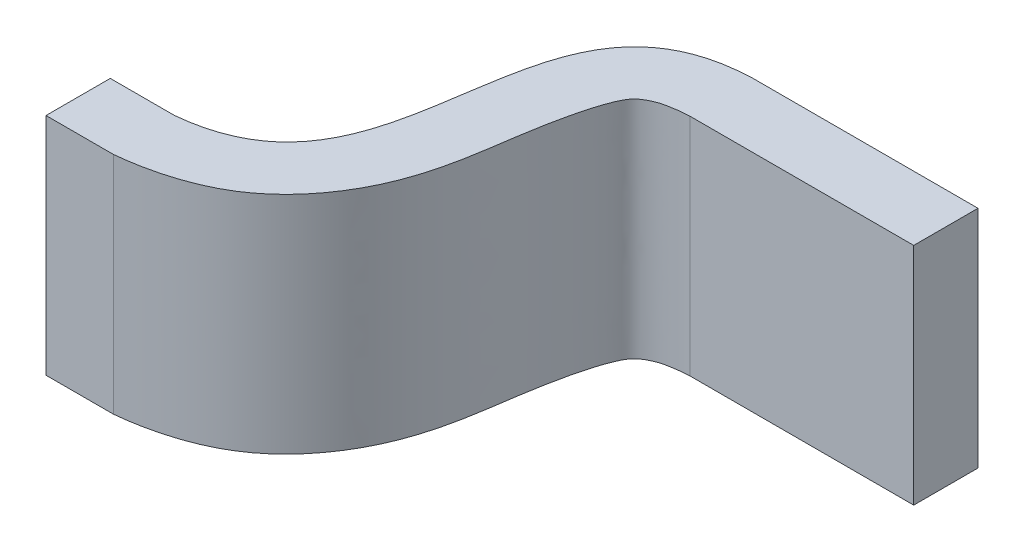
ISO-10303-21;
HEADER;
FILE_DESCRIPTION(('STEP AP214'),'2;1');
FILE_NAME('part.step','',(''),(''),'','','');
FILE_SCHEMA(('AUTOMOTIVE_DESIGN { 1 0 10303 214 1 1 1 1 }'));
ENDSEC;
DATA;
#1=APPLICATION_CONTEXT('core data for automotive mechanical design processes');
#2=APPLICATION_PROTOCOL_DEFINITION('international standard','automotive_design',2000,#1);
#3=PRODUCT_CONTEXT('',#1,'mechanical');
#4=PRODUCT('Part','Part','',(#3));
#5=PRODUCT_RELATED_PRODUCT_CATEGORY('part','',(#4));
#6=PRODUCT_DEFINITION_FORMATION('','',#4);
#7=PRODUCT_DEFINITION_CONTEXT('part definition',#1,'design');
#8=PRODUCT_DEFINITION('design','',#6,#7);
#9=PRODUCT_DEFINITION_SHAPE('','',#8);
#10=(LENGTH_UNIT() NAMED_UNIT(*) SI_UNIT(.MILLI.,.METRE.));
#11=(NAMED_UNIT(*) PLANE_ANGLE_UNIT() SI_UNIT($,.RADIAN.));
#12=(NAMED_UNIT(*) SI_UNIT($,.STERADIAN.) SOLID_ANGLE_UNIT());
#13=UNCERTAINTY_MEASURE_WITH_UNIT(LENGTH_MEASURE(1.E-05),#10,'distance_accuracy_value','');
#14=(GEOMETRIC_REPRESENTATION_CONTEXT(3) GLOBAL_UNCERTAINTY_ASSIGNED_CONTEXT((#13)) GLOBAL_UNIT_ASSIGNED_CONTEXT((#10,
#11,#12)) REPRESENTATION_CONTEXT('',''));
#15=CARTESIAN_POINT('',(0.,0.,0.));
#16=DIRECTION('',(0.,0.,1.));
#17=DIRECTION('',(1.,0.,0.));
#18=AXIS2_PLACEMENT_3D('',#15,#16,#17);
#19=CARTESIAN_POINT('',(0.381062000989914,0.523123965857835,1.2000000284124));
#20=DIRECTION('',(0.,1.,4.37113882867379E-08));
#21=DIRECTION('',(-1.,0.,0.));
#22=AXIS2_PLACEMENT_3D('',#19,#20,#21);
#23=PLANE('',#22);
#24=DIRECTION('',(1.,0.,0.));
#25=VECTOR('',#24,1.);
#26=CARTESIAN_POINT('',(8.21956578272591,0.523124009569223,0.200000028412402));
#27=LINE('',#26,#25);
#28=CARTESIAN_POINT('',(8.21956578272591,0.523124009569223,0.200000028412402));
#29=VERTEX_POINT('',#28);
#30=CARTESIAN_POINT('',(8.91606200098991,0.523124009569223,0.200000028412402));
#31=VERTEX_POINT('',#30);
#32=EDGE_CURVE('E11',#29,#31,#27,.T.);
#33=ORIENTED_EDGE('',*,*,#32,.F.);
#34=CARTESIAN_POINT('',(8.21956578272591,0.523124009569223,0.200000028412402));
#35=CARTESIAN_POINT('',(8.21399807265752,0.52312400955949,0.200222689522129));
#36=CARTESIAN_POINT('',(8.20843683975348,0.523124009544197,0.200572554479812));
#37=CARTESIAN_POINT('',(8.19732835868844,0.523124009503627,0.201500686980735));
#38=CARTESIAN_POINT('',(8.19178112714533,0.523124009478342,0.202079155292227));
#39=CARTESIAN_POINT('',(8.18066889231238,0.523124009418716,0.203443235011885));
#40=CARTESIAN_POINT('',(8.17510408096633,0.523124009384307,0.204230406804731));
#41=CARTESIAN_POINT('',(8.16401243640824,0.52312400930556,0.206031938032742));
#42=CARTESIAN_POINT('',(8.15848559635561,0.523124009261223,0.207046255379066));
#43=CARTESIAN_POINT('',(8.1465743503038,0.523124009148399,0.209627352515907));
#44=CARTESIAN_POINT('',(8.14020246940725,0.5231240090771,0.21125844557323));
#45=CARTESIAN_POINT('',(8.12921644404484,0.523124008918531,0.214886194813635));
#46=CARTESIAN_POINT('',(8.12454576276441,0.523124008839135,0.216702673148474));
#47=CARTESIAN_POINT('',(8.11575076349414,0.523124008662512,0.220743053151341));
#48=CARTESIAN_POINT('',(8.11161057174428,0.523124008566729,0.222933941860099));
#49=CARTESIAN_POINT('',(8.10253183379761,0.523124008340737,0.228105201448088));
#50=CARTESIAN_POINT('',(8.09762635625911,0.523124008207656,0.231151708136343));
#51=CARTESIAN_POINT('',(8.09022405842898,0.523124007950491,0.23703140699628));
#52=CARTESIAN_POINT('',(8.08749164440591,0.523124007840085,0.239554098690417));
#53=CARTESIAN_POINT('',(8.08246087272024,0.523124007602267,0.245002743933271));
#54=CARTESIAN_POINT('',(8.08016330387861,0.523124007474825,0.247929413995591));
#55=CARTESIAN_POINT('',(8.0759951087917,0.523124007211017,0.253960548834216));
#56=CARTESIAN_POINT('',(8.07411551519148,0.523124007074941,0.257059016316074));
#57=CARTESIAN_POINT('',(8.0706064493533,0.523124006798388,0.263392895839739));
#58=CARTESIAN_POINT('',(8.06897710136162,0.523124006657908,0.266628374896965));
#59=CARTESIAN_POINT('',(8.06367328775614,0.523124006170111,0.277849874002466));
#60=CARTESIAN_POINT('',(8.06040085858409,0.523124005813888,0.286022060199968));
#61=CARTESIAN_POINT('',(8.05218527798451,0.523124004834806,0.30842217161417));
#62=CARTESIAN_POINT('',(8.04771455008864,0.523124004202933,0.322813264888977));
#63=CARTESIAN_POINT('',(8.03961753260656,0.523124002947858,0.351469930130036));
#64=CARTESIAN_POINT('',(8.03597437543715,0.523124002324784,0.365730933740904));
#65=CARTESIAN_POINT('',(8.02919339350917,0.523124001073496,0.394362148604283));
#66=CARTESIAN_POINT('',(8.02605527280588,0.523124000445286,0.408732290694726));
#67=CARTESIAN_POINT('',(8.01736410075411,0.523123998591494,0.451139552140372));
#68=CARTESIAN_POINT('',(8.01232518312451,0.523123997361367,0.479282765244954));
#69=CARTESIAN_POINT('',(8.00335647907098,0.52312399489047,0.535811203708824));
#70=CARTESIAN_POINT('',(7.99942969347175,0.52312399364968,0.564196874894819));
#71=CARTESIAN_POINT('',(7.99170167000416,0.523123991397096,0.61572979603454));
#72=CARTESIAN_POINT('',(7.98800715437185,0.523123990384639,0.63889213906133));
#73=CARTESIAN_POINT('',(7.9794355355205,0.523123988368946,0.685005838505776));
#74=CARTESIAN_POINT('',(7.97455858675596,0.523123987365709,0.70795722207379));
#75=CARTESIAN_POINT('',(7.96311271686074,0.523123985382331,0.753331627106404));
#76=CARTESIAN_POINT('',(7.95655194608926,0.523123984402102,0.775756641066975));
#77=CARTESIAN_POINT('',(7.94136784202336,0.523123982472811,0.819893680216221));
#78=CARTESIAN_POINT('',(7.93274558328641,0.523123981523734,0.841606070178963));
#79=CARTESIAN_POINT('',(7.91043792110495,0.523123979401444,0.890158404680554));
#80=CARTESIAN_POINT('',(7.89600936729223,0.523123978242904,0.916662671017735));
#81=CARTESIAN_POINT('',(7.86347434987592,0.523123976024518,0.967413431258293));
#82=CARTESIAN_POINT('',(7.8453597746674,0.523123974964896,0.991654770611745));
#83=CARTESIAN_POINT('',(7.80790002602411,0.523123973106425,1.03417163444858));
#84=CARTESIAN_POINT('',(7.78897432705133,0.523123972291533,1.0528141777067));
#85=CARTESIAN_POINT('',(7.74844565833539,0.523123970804785,1.08682698482442));
#86=CARTESIAN_POINT('',(7.72685155874366,0.523123970132475,1.10220765192534));
#87=CARTESIAN_POINT('',(7.68359472899702,0.52312396901348,1.12780728885139));
#88=CARTESIAN_POINT('',(7.66213857495581,0.523123968551308,1.13838054359417));
#89=CARTESIAN_POINT('',(7.61806563506122,0.523123967740708,1.15692492218508));
#90=CARTESIAN_POINT('',(7.59544469766516,0.523123967392724,1.16488586802287));
#91=CARTESIAN_POINT('',(7.54848495398505,0.523123966783858,1.17881510607821));
#92=CARTESIAN_POINT('',(7.52411482818412,0.523123966527663,1.18467615175865));
#93=CARTESIAN_POINT('',(7.47514110847119,0.52312396611885,1.19402868396042));
#94=CARTESIAN_POINT('',(7.4505414125435,0.523123965965347,1.19754041861071));
#95=CARTESIAN_POINT('',(7.42586117783791,0.523123965857835,1.2000000284124));
#96=B_SPLINE_CURVE_WITH_KNOTS('',3,(#34,#35,#36,#37,#38,#39,#40,#41,#42,#43,#44,#45,#46,#47,#48,
#49,#50,#51,#52,#53,#54,#55,#56,#57,#58,#59,#60,#61,#62,#63,#64,#65,#66,#67,#68,#69,#70,#71,#72,
#73,#74,#75,#76,#77,#78,#79,#80,#81,#82,#83,#84,#85,#86,#87,#88,#89,#90,#91,#92,#93,#94,#95),
.UNSPECIFIED.,.F.,.F.,(4,2,2,2,2,2,2,2,2,2,2,2,2,2,2,2,2,2,2,2,2,2,2,2,2,2,2,2,2,2,4),(0.,
0.0167129049826592,0.0334405206169283,0.0502969119078463,0.0671501823813333,0.086844997792569,
0.101838970321101,0.115885127156847,0.133132127804882,0.144236213112224,0.155360252414285,
0.166215762863006,0.177076645740437,0.203446553112075,0.248618617741088,0.29276509657911,
0.336885611219411,0.422622380023037,0.508588331833531,0.578941414817067,0.649285312924714,
0.719294937731861,0.789268149044622,0.879502218060836,0.969937050040234,1.04934324822107,
1.12849225200605,1.200024637838,1.27183250557101,1.34691026454657,1.42133231106535),.UNSPECIFIED.);
#97=CARTESIAN_POINT('',(7.42586117783791,0.523123965857835,1.2000000284124));
#98=VERTEX_POINT('',#97);
#99=EDGE_CURVE('E186',#29,#98,#96,.T.);
#100=ORIENTED_EDGE('',*,*,#99,.T.);
#101=DIRECTION('',(1.,0.,0.));
#102=VECTOR('',#101,1.);
#103=CARTESIAN_POINT('',(7.21606200098991,0.523123965857834,1.2000000284124));
#104=LINE('',#103,#102);
#105=CARTESIAN_POINT('',(7.21606200098991,0.523123965857835,1.2000000284124));
#106=VERTEX_POINT('',#105);
#107=EDGE_CURVE('E163',#106,#98,#104,.T.);
#108=ORIENTED_EDGE('',*,*,#107,.F.);
#109=DIRECTION('',(0.,4.37113883977602E-08,-0.999999999999999));
#110=VECTOR('',#109,1.);
#111=CARTESIAN_POINT('',(7.21606200098991,0.523123965857835,1.2000000284124));
#112=LINE('',#111,#110);
#113=CARTESIAN_POINT('',(7.21606200098991,0.523123974600112,1.0000000284124));
#114=VERTEX_POINT('',#113);
#115=EDGE_CURVE('E155',#106,#114,#112,.T.);
#116=ORIENTED_EDGE('',*,*,#115,.T.);
#117=DIRECTION('',(-1.,0.,0.));
#118=VECTOR('',#117,1.);
#119=CARTESIAN_POINT('',(7.41606200098991,0.523123974600113,1.0000000284124));
#120=LINE('',#119,#118);
#121=CARTESIAN_POINT('',(7.41606200098991,0.523123974600112,1.0000000284124));
#122=VERTEX_POINT('',#121);
#123=EDGE_CURVE('E148',#122,#114,#120,.T.);
#124=ORIENTED_EDGE('',*,*,#123,.F.);
#125=CARTESIAN_POINT('',(8.21606200098991,0.523124018311501,2.84124024121632E-08));
#126=CARTESIAN_POINT('',(8.19358510313693,0.523124018278632,0.000751973045804594));
#127=CARTESIAN_POINT('',(8.17100793476501,0.523124018200959,0.00252892635576407));
#128=CARTESIAN_POINT('',(8.12597309478915,0.523124017918698,0.00898631281109999));
#129=CARTESIAN_POINT('',(8.10352138339691,0.523124017712372,0.0137065199884059));
#130=CARTESIAN_POINT('',(8.06515365819845,0.523124017206176,0.0252869208885321));
#131=CARTESIAN_POINT('',(8.04899929251523,0.523124016942265,0.0313244996495291));
#132=CARTESIAN_POINT('',(8.01789140683102,0.523124016308798,0.0458165330653677));
#133=CARTESIAN_POINT('',(8.00293202850773,0.523124015939804,0.0542581347862222));
#134=CARTESIAN_POINT('',(7.97580927414815,0.523124015127175,0.0728489137987579));
#135=CARTESIAN_POINT('',(7.96351851659414,0.523124014691697,0.0828114897177421));
#136=CARTESIAN_POINT('',(7.94069381725784,0.523124013739438,0.104596633966451));
#137=CARTESIAN_POINT('',(7.93016206041085,0.523124013222557,0.116421480619356));
#138=CARTESIAN_POINT('',(7.90934268339576,0.523124012034324,0.143605077884774));
#139=CARTESIAN_POINT('',(7.89939730340265,0.52312401135163,0.159223306458098));
#140=CARTESIAN_POINT('',(7.8817786902267,0.523124009931813,0.191704937205947));
#141=CARTESIAN_POINT('',(7.87411125124448,0.523124009194558,0.208571380664586));
#142=CARTESIAN_POINT('',(7.85831224281672,0.523124007435963,0.248803345104274));
#143=CARTESIAN_POINT('',(7.85089650929936,0.523124006402683,0.272442033282066));
#144=CARTESIAN_POINT('',(7.83819654268846,0.523124004313759,0.320231039974889));
#145=CARTESIAN_POINT('',(7.83291120075709,0.523124003258126,0.344381085428394));
#146=CARTESIAN_POINT('',(7.82019523572656,0.523124000384108,0.41013095442911));
#147=CARTESIAN_POINT('',(7.81390954748545,0.523123998556826,0.451934314660284));
#148=CARTESIAN_POINT('',(7.80123041061268,0.523123994892434,0.535765841283035));
#149=CARTESIAN_POINT('',(7.79483655698354,0.523123993055326,0.577793964269863));
#150=CARTESIAN_POINT('',(7.78272745030488,0.523123990363762,0.6393697611756));
#151=CARTESIAN_POINT('',(7.77840818033406,0.523123989498192,0.659171695464002));
#152=CARTESIAN_POINT('',(7.76846333575577,0.523123987780332,0.698471750789634));
#153=CARTESIAN_POINT('',(7.76283677771603,0.523123986928053,0.717969631254131));
#154=CARTESIAN_POINT('',(7.74980357127117,0.523123985258905,0.756155277243095));
#155=CARTESIAN_POINT('',(7.7424162483515,0.523123984441759,0.774849402330931));
#156=CARTESIAN_POINT('',(7.72528765923403,0.523123982856935,0.811105960776874));
#157=CARTESIAN_POINT('',(7.71555219177743,0.523123982089141,0.828671049014009));
#158=CARTESIAN_POINT('',(7.69291712212291,0.523123980608703,0.862539528703548));
#159=CARTESIAN_POINT('',(7.67992280719315,0.523123979898752,0.878781289982292));
#160=CARTESIAN_POINT('',(7.6509915949129,0.523123978604453,0.908391388716107));
#161=CARTESIAN_POINT('',(7.63505740825526,0.523123978019989,0.921762348802611));
#162=CARTESIAN_POINT('',(7.60251216289671,0.523123977046078,0.944042841853135));
#163=CARTESIAN_POINT('',(7.58610329850445,0.523123976643516,0.953252414485398));
#164=CARTESIAN_POINT('',(7.55200247896581,0.523123975953836,0.969030441043196));
#165=CARTESIAN_POINT('',(7.53430550805647,0.523123975667202,0.975587838389974));
#166=CARTESIAN_POINT('',(7.49987529020758,0.523123975217356,0.985879127327204));
#167=CARTESIAN_POINT('',(7.48319962545166,0.523123975045326,0.989814734575921));
#168=CARTESIAN_POINT('',(7.44971156339336,0.523123974773376,0.996036229262667));
#169=CARTESIAN_POINT('',(7.43290223265527,0.523123974672748,0.998338325880506));
#170=CARTESIAN_POINT('',(7.41606200098991,0.523123974600112,1.0000000284124));
#171=B_SPLINE_CURVE_WITH_KNOTS('',3,(#125,#126,#127,#128,#129,#130,#131,#132,#133,#134,#135,
#136,#137,#138,#139,#140,#141,#142,#143,#144,#145,#146,#147,#148,#149,#150,#151,#152,#153,#154,
#155,#156,#157,#158,#159,#160,#161,#162,#163,#164,#165,#166,#167,#168,#169,#170),.UNSPECIFIED.,
.F.,.F.,(4,2,2,2,2,2,2,2,2,2,2,2,2,2,2,2,2,2,2,2,2,2,4),(0.,0.0676605368254322,
0.136255841823736,0.187815232472042,0.239103979458815,0.28635747593516,0.333669238509404,
0.38897897184657,0.444428210357159,0.518581097757562,0.592695339665635,0.719482422739692,
0.846974988060578,0.907746805484854,0.968564488536604,1.02874313069962,1.08877465652057,
1.15080863583323,1.21278570033354,1.2689745883637,1.32539536427915,1.3767136749948,
1.42751535438906),.UNSPECIFIED.);
#172=CARTESIAN_POINT('',(8.21606200098991,0.523124018311501,2.84124023863797E-08));
#173=VERTEX_POINT('',#172);
#174=EDGE_CURVE('E99',#173,#122,#171,.T.);
#175=ORIENTED_EDGE('',*,*,#174,.F.);
#176=DIRECTION('',(1.,0.,0.));
#177=VECTOR('',#176,1.);
#178=CARTESIAN_POINT('',(8.21606200098991,0.523124018311501,2.84124023863797E-08));
#179=LINE('',#178,#177);
#180=CARTESIAN_POINT('',(8.91606200098991,0.523124018311501,2.84124023863797E-08));
#181=VERTEX_POINT('',#180);
#182=EDGE_CURVE('E93',#173,#181,#179,.T.);
#183=ORIENTED_EDGE('',*,*,#182,.T.);
#184=DIRECTION('',(0.,4.37113883977602E-08,-0.999999999999999));
#185=VECTOR('',#184,1.);
#186=CARTESIAN_POINT('',(8.91606200098991,0.523124009569223,0.200000028412402));
#187=LINE('',#186,#185);
#188=EDGE_CURVE('E194',#31,#181,#187,.T.);
#189=ORIENTED_EDGE('',*,*,#188,.F.);
#190=EDGE_LOOP('',(#33,#100,#108,#116,#124,#175,#183,#189));
#191=FACE_BOUND('',#190,.T.);
#192=ADVANCED_FACE('F17',(#191),#23,.F.);
#193=CARTESIAN_POINT('',(8.91606200098991,-0.126876034142165,1.2));
#194=DIRECTION('',(-1.,0.,0.));
#195=DIRECTION('',(0.,-1.,-4.37113882867379E-08));
#196=AXIS2_PLACEMENT_3D('',#193,#194,#195);
#197=PLANE('',#196);
#198=DIRECTION('',(0.,-0.999999999999999,-4.37113881598552E-08));
#199=VECTOR('',#198,1.);
#200=CARTESIAN_POINT('',(8.91606200098991,1.22312400956922,0.200000059010374));
#201=LINE('',#200,#199);
#202=CARTESIAN_POINT('',(8.91606200098991,1.22312400956922,0.200000059010374));
#203=VERTEX_POINT('',#202);
#204=EDGE_CURVE('E25',#203,#31,#201,.T.);
#205=ORIENTED_EDGE('',*,*,#204,.T.);
#206=ORIENTED_EDGE('',*,*,#188,.T.);
#207=DIRECTION('',(0.,0.999999999999999,4.37113882867379E-08));
#208=VECTOR('',#207,1.);
#209=CARTESIAN_POINT('',(8.91606200098991,0.523124018311501,2.84124023863797E-08));
#210=LINE('',#209,#208);
#211=CARTESIAN_POINT('',(8.91606200098991,1.2231240183115,5.90103741870962E-08));
#212=VERTEX_POINT('',#211);
#213=EDGE_CURVE('E157',#181,#212,#210,.T.);
#214=ORIENTED_EDGE('',*,*,#213,.T.);
#215=DIRECTION('',(0.,4.37113878426487E-08,-0.999999999999999));
#216=VECTOR('',#215,1.);
#217=CARTESIAN_POINT('',(8.91606200098991,1.22312400956922,0.200000059010374));
#218=LINE('',#217,#216);
#219=EDGE_CURVE('E150',#203,#212,#218,.T.);
#220=ORIENTED_EDGE('',*,*,#219,.F.);
#221=EDGE_LOOP('',(#205,#206,#214,#220));
#222=FACE_BOUND('',#221,.T.);
#223=ADVANCED_FACE('F205',(#222),#197,.F.);
#224=CARTESIAN_POINT('',(0.381062000989914,1.22312396585783,1.20000005901037));
#225=DIRECTION('',(0.,1.,4.37113882867379E-08));
#226=DIRECTION('',(-1.,0.,0.));
#227=AXIS2_PLACEMENT_3D('',#224,#225,#226);
#228=PLANE('',#227);
#229=CARTESIAN_POINT('',(8.21956578272591,1.22312400956922,0.200000059010374));
#230=CARTESIAN_POINT('',(8.21399807265752,1.22312400955948,0.200222720120101));
#231=CARTESIAN_POINT('',(8.20843683975348,1.22312400954419,0.200572585077784));
#232=CARTESIAN_POINT('',(8.19732835868844,1.22312400950362,0.201500717578707));
#233=CARTESIAN_POINT('',(8.19178112714533,1.22312400947834,0.202079185890199));
#234=CARTESIAN_POINT('',(8.18066889231238,1.22312400941871,0.203443265609857));
#235=CARTESIAN_POINT('',(8.17510408096633,1.2231240093843,0.204230437402703));
#236=CARTESIAN_POINT('',(8.16401243640824,1.22312400930556,0.206031968630714));
#237=CARTESIAN_POINT('',(8.15848559635561,1.22312400926122,0.207046285977038));
#238=CARTESIAN_POINT('',(8.1465743503038,1.22312400914841,0.209627383113879));
#239=CARTESIAN_POINT('',(8.14020246940725,1.22312400907711,0.211258476171202));
#240=CARTESIAN_POINT('',(8.12921644404484,1.22312400891852,0.214886225411607));
#241=CARTESIAN_POINT('',(8.12454576276441,1.22312400883912,0.216702703746445));
#242=CARTESIAN_POINT('',(8.11575076349414,1.22312400866253,0.220743083749313));
#243=CARTESIAN_POINT('',(8.11161057174428,1.22312400856678,0.222933972458071));
#244=CARTESIAN_POINT('',(8.10253183379761,1.22312400834067,0.22810523204606));
#245=CARTESIAN_POINT('',(8.09762635625911,1.22312400820737,0.231151738734314));
#246=CARTESIAN_POINT('',(8.09022405842899,1.22312400795059,0.237031437594252));
#247=CARTESIAN_POINT('',(8.08749164440591,1.22312400784052,0.239554129288389));
#248=CARTESIAN_POINT('',(8.08246087272025,1.22312400760182,0.245002774531244));
#249=CARTESIAN_POINT('',(8.08016330387861,1.22312400747317,0.247929444593563));
#250=CARTESIAN_POINT('',(8.0759951087917,1.22312400720981,0.253960579432188));
#251=CARTESIAN_POINT('',(8.07411551519148,1.22312400707532,0.257059046914046));
#252=CARTESIAN_POINT('',(8.0706064493533,1.22312400679799,0.263392926437711));
#253=CARTESIAN_POINT('',(8.06897710136162,1.22312400665515,0.266628405494937));
#254=CARTESIAN_POINT('',(8.06367328775614,1.22312400616057,0.277849904600438));
#255=CARTESIAN_POINT('',(8.06040085858409,1.22312400580186,0.28602209079794));
#256=CARTESIAN_POINT('',(8.05218527798451,1.22312400482263,0.308422202212142));
#257=CARTESIAN_POINT('',(8.04771455008864,1.22312400419781,0.322813295486949));
#258=CARTESIAN_POINT('',(8.03961753260656,1.22312400294887,0.351469960728008));
#259=CARTESIAN_POINT('',(8.03597437543715,1.22312400232506,0.365730964338876));
#260=CARTESIAN_POINT('',(8.02919339350917,1.22312400107321,0.394362179202255));
#261=CARTESIAN_POINT('',(8.02605527280588,1.22312400044518,0.408732321292698));
#262=CARTESIAN_POINT('',(8.01736410075411,1.22312399859167,0.451139582738344));
#263=CARTESIAN_POINT('',(8.01232518312452,1.22312399736141,0.479282795842926));
#264=CARTESIAN_POINT('',(8.00335647907099,1.22312399489041,0.535811234306796));
#265=CARTESIAN_POINT('',(7.99942969347175,1.22312399364966,0.564196905492791));
#266=CARTESIAN_POINT('',(7.99170167000416,1.2231239913971,0.615729826632512));
#267=CARTESIAN_POINT('',(7.98800715437185,1.22312399038463,0.638892169659302));
#268=CARTESIAN_POINT('',(7.9794355355205,1.22312398836894,0.685005869103749));
#269=CARTESIAN_POINT('',(7.97455858675596,1.2231239873657,0.707957252671762));
#270=CARTESIAN_POINT('',(7.96311271686074,1.22312398538232,0.753331657704376));
#271=CARTESIAN_POINT('',(7.95655194608926,1.22312398440209,0.775756671664947));
#272=CARTESIAN_POINT('',(7.94136784202336,1.22312398247281,0.819893710814193));
#273=CARTESIAN_POINT('',(7.93274558328641,1.22312398152374,0.841606100776935));
#274=CARTESIAN_POINT('',(7.91043792110495,1.22312397940145,0.890158435278525));
#275=CARTESIAN_POINT('',(7.89600936729223,1.2231239782429,0.916662701615707));
#276=CARTESIAN_POINT('',(7.86347434987592,1.22312397602451,0.967413461856264));
#277=CARTESIAN_POINT('',(7.8453597746674,1.2231239749649,0.991654801209715));
#278=CARTESIAN_POINT('',(7.80790002602411,1.22312397310642,1.03417166504655));
#279=CARTESIAN_POINT('',(7.78897432705133,1.22312397229153,1.05281420830467));
#280=CARTESIAN_POINT('',(7.74844565833539,1.22312397080478,1.08682701542239));
#281=CARTESIAN_POINT('',(7.72685155874366,1.22312397013248,1.10220768252331));
#282=CARTESIAN_POINT('',(7.68359472899701,1.22312396901348,1.12780731944936));
#283=CARTESIAN_POINT('',(7.66213857495581,1.2231239685513,1.13838057419214));
#284=CARTESIAN_POINT('',(7.61806563506122,1.2231239677407,1.15692495278305));
#285=CARTESIAN_POINT('',(7.59544469766516,1.22312396739272,1.16488589862084));
#286=CARTESIAN_POINT('',(7.54848495398505,1.22312396678386,1.17881513667618));
#287=CARTESIAN_POINT('',(7.52411482818412,1.22312396652766,1.18467618235662));
#288=CARTESIAN_POINT('',(7.47514110847119,1.22312396611884,1.19402871455839));
#289=CARTESIAN_POINT('',(7.4505414125435,1.22312396596533,1.19754044920868));
#290=CARTESIAN_POINT('',(7.42586117783791,1.22312396585783,1.20000005901037));
#291=B_SPLINE_CURVE_WITH_KNOTS('',3,(#229,#230,#231,#232,#233,#234,#235,#236,#237,#238,#239,
#240,#241,#242,#243,#244,#245,#246,#247,#248,#249,#250,#251,#252,#253,#254,#255,#256,#257,#258,
#259,#260,#261,#262,#263,#264,#265,#266,#267,#268,#269,#270,#271,#272,#273,#274,#275,#276,#277,
#278,#279,#280,#281,#282,#283,#284,#285,#286,#287,#288,#289,#290),.UNSPECIFIED.,.F.,.F.,(4,2,2,
2,2,2,2,2,2,2,2,2,2,2,2,2,2,2,2,2,2,2,2,2,2,2,2,2,2,2,4),(0.,0.0167129049826592,
0.0334405206169283,0.0502969119078462,0.0671501823813333,0.086844997792569,0.101838970321101,
0.115885127156847,0.133132127804882,0.144236213112223,0.155360252414285,0.166215762863006,
0.177076645740437,0.203446553112075,0.248618617741088,0.29276509657911,0.336885611219411,
0.422622380023037,0.508588331833531,0.578941414817067,0.649285312924714,0.719294937731861,
0.789268149044622,0.879502218060835,0.969937050040232,1.04934324822106,1.12849225200604,
1.200024637838,1.27183250557101,1.34691026454656,1.42133231106535),.UNSPECIFIED.);
#292=CARTESIAN_POINT('',(8.21956578272591,1.22312400956922,0.200000059010374));
#293=VERTEX_POINT('',#292);
#294=CARTESIAN_POINT('',(7.42586117783791,1.22312396585783,1.20000005901037));
#295=VERTEX_POINT('',#294);
#296=EDGE_CURVE('E180',#293,#295,#291,.T.);
#297=ORIENTED_EDGE('',*,*,#296,.F.);
#298=DIRECTION('',(1.,0.,0.));
#299=VECTOR('',#298,1.);
#300=CARTESIAN_POINT('',(8.21956578272592,1.22312400956922,0.200000059010374));
#301=LINE('',#300,#299);
#302=EDGE_CURVE('E159',#293,#203,#301,.T.);
#303=ORIENTED_EDGE('',*,*,#302,.T.);
#304=ORIENTED_EDGE('',*,*,#219,.T.);
#305=DIRECTION('',(1.,0.,0.));
#306=VECTOR('',#305,1.);
#307=CARTESIAN_POINT('',(8.21606200098991,1.2231240183115,5.90103741870962E-08));
#308=LINE('',#307,#306);
#309=CARTESIAN_POINT('',(8.21606200098991,1.2231240183115,5.90103741870962E-08));
#310=VERTEX_POINT('',#309);
#311=EDGE_CURVE('E89',#310,#212,#308,.T.);
#312=ORIENTED_EDGE('',*,*,#311,.F.);
#313=CARTESIAN_POINT('',(8.21606200098991,1.2231240183115,5.90103741684708E-08));
#314=CARTESIAN_POINT('',(8.19358510313693,1.22312401827862,0.00075200364377632));
#315=CARTESIAN_POINT('',(8.17100793476501,1.22312401820095,0.00252895695373583));
#316=CARTESIAN_POINT('',(8.12597309478915,1.2231240179187,0.00898634340907184));
#317=CARTESIAN_POINT('',(8.10352138339691,1.22312401771237,0.0137065505863778));
#318=CARTESIAN_POINT('',(8.06515365819845,1.22312401720618,0.025286951486504));
#319=CARTESIAN_POINT('',(8.04899929251523,1.22312401694226,0.031324530247501));
#320=CARTESIAN_POINT('',(8.01789140683102,1.22312401630879,0.0458165636633395));
#321=CARTESIAN_POINT('',(8.00293202850773,1.2231240159398,0.0542581653841941));
#322=CARTESIAN_POINT('',(7.97580927414815,1.22312401512717,0.0728489443967298));
#323=CARTESIAN_POINT('',(7.96351851659414,1.22312401469169,0.0828115203157142));
#324=CARTESIAN_POINT('',(7.94069381725784,1.22312401373943,0.104596664564423));
#325=CARTESIAN_POINT('',(7.93016206041085,1.22312401322255,0.116421511217328));
#326=CARTESIAN_POINT('',(7.90934268339576,1.22312401203432,0.143605108482746));
#327=CARTESIAN_POINT('',(7.89939730340264,1.22312401135162,0.15922333705607));
#328=CARTESIAN_POINT('',(7.8817786902267,1.22312400993181,0.191704967803919));
#329=CARTESIAN_POINT('',(7.87411125124448,1.22312400919456,0.208571411262558));
#330=CARTESIAN_POINT('',(7.85831224281672,1.22312400743597,0.248803375702247));
#331=CARTESIAN_POINT('',(7.85089650929935,1.22312400640268,0.272442063880037));
#332=CARTESIAN_POINT('',(7.83819654268846,1.22312400431375,0.32023107057286));
#333=CARTESIAN_POINT('',(7.83291120075709,1.22312400325813,0.344381116026366));
#334=CARTESIAN_POINT('',(7.82019523572656,1.22312400038412,0.410130985027082));
#335=CARTESIAN_POINT('',(7.81390954748546,1.22312399855682,0.451934345258256));
#336=CARTESIAN_POINT('',(7.80123041061269,1.22312399489243,0.535765871881008));
#337=CARTESIAN_POINT('',(7.79483655698354,1.22312399305533,0.577793994867835));
#338=CARTESIAN_POINT('',(7.78272745030488,1.22312399036376,0.639369791773571));
#339=CARTESIAN_POINT('',(7.77840818033405,1.22312398949819,0.659171726061974));
#340=CARTESIAN_POINT('',(7.76846333575577,1.22312398778032,0.698471781387606));
#341=CARTESIAN_POINT('',(7.76283677771603,1.22312398692805,0.717969661852104));
#342=CARTESIAN_POINT('',(7.74980357127116,1.2231239852589,0.756155307841067));
#343=CARTESIAN_POINT('',(7.74241624835149,1.22312398444175,0.774849432928902));
#344=CARTESIAN_POINT('',(7.72528765923403,1.22312398285693,0.811105991374845));
#345=CARTESIAN_POINT('',(7.71555219177743,1.22312398208914,0.828671079611981));
#346=CARTESIAN_POINT('',(7.69291712212291,1.2231239806087,0.86253955930152));
#347=CARTESIAN_POINT('',(7.67992280719315,1.22312397989874,0.878781320580263));
#348=CARTESIAN_POINT('',(7.6509915949129,1.22312397860445,0.908391419314078));
#349=CARTESIAN_POINT('',(7.63505740825526,1.22312397801999,0.921762379400582));
#350=CARTESIAN_POINT('',(7.60251216289671,1.22312397704608,0.944042872451107));
#351=CARTESIAN_POINT('',(7.58610329850445,1.22312397664351,0.95325244508337));
#352=CARTESIAN_POINT('',(7.55200247896581,1.22312397595383,0.969030471641168));
#353=CARTESIAN_POINT('',(7.53430550805647,1.22312397566721,0.975587868987946));
#354=CARTESIAN_POINT('',(7.49987529020758,1.22312397521736,0.985879157925176));
#355=CARTESIAN_POINT('',(7.48319962545166,1.22312397504532,0.989814765173893));
#356=CARTESIAN_POINT('',(7.44971156339336,1.22312397477337,0.996036259860638));
#357=CARTESIAN_POINT('',(7.43290223265527,1.22312397467274,0.998338356478477));
#358=CARTESIAN_POINT('',(7.41606200098991,1.22312397460011,1.00000005901037));
#359=B_SPLINE_CURVE_WITH_KNOTS('',3,(#313,#314,#315,#316,#317,#318,#319,#320,#321,#322,#323,
#324,#325,#326,#327,#328,#329,#330,#331,#332,#333,#334,#335,#336,#337,#338,#339,#340,#341,#342,
#343,#344,#345,#346,#347,#348,#349,#350,#351,#352,#353,#354,#355,#356,#357,#358),.UNSPECIFIED.,
.F.,.F.,(4,2,2,2,2,2,2,2,2,2,2,2,2,2,2,2,2,2,2,2,2,2,4),(0.,0.0676605368254322,
0.136255841823736,0.187815232472042,0.239103979458815,0.28635747593516,0.333669238509404,
0.388978971846571,0.44442821035716,0.518581097757563,0.592695339665636,0.719482422739693,
0.846974988060579,0.907746805484855,0.968564488536605,1.02874313069962,1.08877465652057,
1.15080863583323,1.21278570033354,1.2689745883637,1.32539536427915,1.3767136749948,
1.42751535438906),.UNSPECIFIED.);
#360=CARTESIAN_POINT('',(7.41606200098991,1.22312397460011,1.00000005901037));
#361=VERTEX_POINT('',#360);
#362=EDGE_CURVE('E81',#310,#361,#359,.T.);
#363=ORIENTED_EDGE('',*,*,#362,.T.);
#364=DIRECTION('',(-1.,0.,0.));
#365=VECTOR('',#364,1.);
#366=CARTESIAN_POINT('',(7.41606200098991,1.22312397460011,1.00000005901037));
#367=LINE('',#366,#365);
#368=CARTESIAN_POINT('',(7.21606200098991,1.22312397460011,1.00000005901037));
#369=VERTEX_POINT('',#368);
#370=EDGE_CURVE('E86',#361,#369,#367,.T.);
#371=ORIENTED_EDGE('',*,*,#370,.T.);
#372=DIRECTION('',(0.,4.37113878426487E-08,-0.999999999999999));
#373=VECTOR('',#372,1.);
#374=CARTESIAN_POINT('',(7.21606200098991,1.22312396585783,1.20000005901037));
#375=LINE('',#374,#373);
#376=CARTESIAN_POINT('',(7.21606200098991,1.22312396585783,1.20000005901037));
#377=VERTEX_POINT('',#376);
#378=EDGE_CURVE('E161',#377,#369,#375,.T.);
#379=ORIENTED_EDGE('',*,*,#378,.F.);
#380=DIRECTION('',(1.,0.,0.));
#381=VECTOR('',#380,1.);
#382=CARTESIAN_POINT('',(7.21606200098992,1.22312396585783,1.20000005901037));
#383=LINE('',#382,#381);
#384=EDGE_CURVE('E208',#377,#295,#383,.T.);
#385=ORIENTED_EDGE('',*,*,#384,.T.);
#386=EDGE_LOOP('',(#297,#303,#304,#312,#363,#371,#379,#385));
#387=FACE_BOUND('',#386,.T.);
#388=ADVANCED_FACE('F83',(#387),#228,.T.);
#389=CARTESIAN_POINT('',(7.21606200098991,-0.126876034142165,1.2));
#390=DIRECTION('',(-1.,0.,0.));
#391=DIRECTION('',(0.,-1.,-4.37113882867379E-08));
#392=AXIS2_PLACEMENT_3D('',#389,#390,#391);
#393=PLANE('',#392);
#394=ORIENTED_EDGE('',*,*,#378,.T.);
#395=DIRECTION('',(0.,-0.999999999999999,-4.37113881598552E-08));
#396=VECTOR('',#395,1.);
#397=CARTESIAN_POINT('',(7.21606200098992,1.22312397460011,1.00000005901037));
#398=LINE('',#397,#396);
#399=EDGE_CURVE('E107',#369,#114,#398,.T.);
#400=ORIENTED_EDGE('',*,*,#399,.T.);
#401=ORIENTED_EDGE('',*,*,#115,.F.);
#402=DIRECTION('',(0.,0.999999999999999,4.37113881598552E-08));
#403=VECTOR('',#402,1.);
#404=CARTESIAN_POINT('',(7.21606200098991,0.523123965857835,1.2000000284124));
#405=LINE('',#404,#403);
#406=EDGE_CURVE('E92',#106,#377,#405,.T.);
#407=ORIENTED_EDGE('',*,*,#406,.T.);
#408=EDGE_LOOP('',(#394,#400,#401,#407));
#409=FACE_BOUND('',#408,.T.);
#410=ADVANCED_FACE('F177',(#409),#393,.T.);
#411=CARTESIAN_POINT('',(0.381062000989914,-0.126875981688499,0.));
#412=DIRECTION('',(0.,-4.37113882867379E-08,1.));
#413=DIRECTION('',(0.,-1.,-4.37113882867379E-08));
#414=AXIS2_PLACEMENT_3D('',#411,#412,#413);
#415=PLANE('',#414);
#416=DIRECTION('',(0.,-0.999999999999999,-4.37113882867379E-08));
#417=VECTOR('',#416,1.);
#418=CARTESIAN_POINT('',(8.21606200098991,1.2231240183115,5.90103741870962E-08));
#419=LINE('',#418,#417);
#420=EDGE_CURVE('E153',#310,#173,#419,.T.);
#421=ORIENTED_EDGE('',*,*,#420,.F.);
#422=ORIENTED_EDGE('',*,*,#311,.T.);
#423=ORIENTED_EDGE('',*,*,#213,.F.);
#424=ORIENTED_EDGE('',*,*,#182,.F.);
#425=EDGE_LOOP('',(#421,#422,#423,#424));
#426=FACE_BOUND('',#425,.T.);
#427=ADVANCED_FACE('F129',(#426),#415,.F.);
#428=CARTESIAN_POINT('',(0.381062000989914,-0.126876034142165,1.2));
#429=DIRECTION('',(0.,-4.37113882867379E-08,1.));
#430=DIRECTION('',(0.,-1.,-4.37113882867379E-08));
#431=AXIS2_PLACEMENT_3D('',#428,#429,#430);
#432=PLANE('',#431);
#433=DIRECTION('',(0.,-0.999999999999999,-4.37113881598552E-08));
#434=VECTOR('',#433,1.);
#435=CARTESIAN_POINT('',(7.42586117783792,1.22312396585783,1.20000005901037));
#436=LINE('',#435,#434);
#437=EDGE_CURVE('E145',#295,#98,#436,.T.);
#438=ORIENTED_EDGE('',*,*,#437,.F.);
#439=ORIENTED_EDGE('',*,*,#384,.F.);
#440=ORIENTED_EDGE('',*,*,#406,.F.);
#441=ORIENTED_EDGE('',*,*,#107,.T.);
#442=EDGE_LOOP('',(#438,#439,#440,#441));
#443=FACE_BOUND('',#442,.T.);
#444=ADVANCED_FACE('F199',(#443),#432,.T.);
#445=CARTESIAN_POINT('',(0.381062000989914,5.01775443609411,1.00000022487894));
#446=DIRECTION('',(0.,4.37113882867379E-08,-1.));
#447=DIRECTION('',(0.,1.,4.37113882867379E-08));
#448=AXIS2_PLACEMENT_3D('',#445,#446,#447);
#449=PLANE('',#448);
#450=ORIENTED_EDGE('',*,*,#123,.T.);
#451=ORIENTED_EDGE('',*,*,#399,.F.);
#452=ORIENTED_EDGE('',*,*,#370,.F.);
#453=DIRECTION('',(0.,-0.999999999999999,-4.37113881598552E-08));
#454=VECTOR('',#453,1.);
#455=CARTESIAN_POINT('',(7.41606200098991,1.22312397460011,1.00000005901037));
#456=LINE('',#455,#454);
#457=EDGE_CURVE('E97',#361,#122,#456,.T.);
#458=ORIENTED_EDGE('',*,*,#457,.T.);
#459=EDGE_LOOP('',(#450,#451,#452,#458));
#460=FACE_BOUND('',#459,.T.);
#461=ADVANCED_FACE('F105',(#460),#449,.T.);
#462=CARTESIAN_POINT('',(7.41606200098991,5.01775443609411,1.00000022487894));
#463=CARTESIAN_POINT('',(8.06137939913391,5.01775443886489,0.93661226287194));
#464=CARTESIAN_POINT('',(7.55196529161691,5.01775447886606,0.0214920441178097));
#465=CARTESIAN_POINT('',(8.21606200098991,5.0177544798055,2.24878939694144E-07));
#466=B_SPLINE_CURVE_WITH_KNOTS('',3,(#462,#463,#464,#465),.UNSPECIFIED.,.F.,.F.,(4,4),(0.,1.),.UNSPECIFIED.);
#467=DIRECTION('',(0.,-0.999999999999999,-4.37113882867379E-08));
#468=VECTOR('',#467,1.);
#469=SURFACE_OF_LINEAR_EXTRUSION('',#466,#468);
#470=ORIENTED_EDGE('',*,*,#174,.T.);
#471=ORIENTED_EDGE('',*,*,#457,.F.);
#472=ORIENTED_EDGE('',*,*,#362,.F.);
#473=ORIENTED_EDGE('',*,*,#420,.T.);
#474=EDGE_LOOP('',(#470,#471,#472,#473));
#475=FACE_BOUND('',#474,.T.);
#476=ADVANCED_FACE('F98',(#475),#469,.T.);
#477=CARTESIAN_POINT('',(0.381062000989914,5.01775447106322,0.20000022487894));
#478=DIRECTION('',(0.,-4.37113882867379E-08,1.));
#479=DIRECTION('',(-1.,0.,0.));
#480=AXIS2_PLACEMENT_3D('',#477,#478,#479);
#481=PLANE('',#480);
#482=ORIENTED_EDGE('',*,*,#32,.T.);
#483=ORIENTED_EDGE('',*,*,#204,.F.);
#484=ORIENTED_EDGE('',*,*,#302,.F.);
#485=DIRECTION('',(0.,-0.999999999999999,-4.37113881598552E-08));
#486=VECTOR('',#485,1.);
#487=CARTESIAN_POINT('',(8.21956578272592,1.22312400956922,0.200000059010374));
#488=LINE('',#487,#486);
#489=EDGE_CURVE('E102',#293,#29,#488,.T.);
#490=ORIENTED_EDGE('',*,*,#489,.T.);
#491=EDGE_LOOP('',(#482,#483,#484,#490));
#492=FACE_BOUND('',#491,.T.);
#493=ADVANCED_FACE('F128',(#492),#481,.T.);
#494=CARTESIAN_POINT('',(7.42586117783791,5.01775442735183,1.20000022487894));
#495=CARTESIAN_POINT('',(7.52323557934491,5.01775442776993,1.19043537372094));
#496=CARTESIAN_POINT('',(7.72758399467491,5.01775443018266,1.13523848292794));
#497=CARTESIAN_POINT('',(7.96817675723591,5.01775444236442,0.85655227210794));
#498=CARTESIAN_POINT('',(8.00047382700591,5.01775445822105,0.49379478761794));
#499=CARTESIAN_POINT('',(8.06032189164391,5.01775446848464,0.25899132482694));
#500=CARTESIAN_POINT('',(8.09817849874591,5.0177544697967,0.22897490490494));
#501=CARTESIAN_POINT('',(8.14111952633391,5.01775447070118,0.20828275194794));
#502=CARTESIAN_POINT('',(8.19602789838591,5.01775447102387,0.20090043049794));
#503=CARTESIAN_POINT('',(8.21956578272591,5.01775447106322,0.20000022487894));
#504=B_SPLINE_CURVE_WITH_KNOTS('',3,(#494,#495,#496,#497,#498,#499,#500,#501,#502,#503),
.UNSPECIFIED.,.F.,.F.,(4,1,1,1,1,1,1,4),(-0.005037439357121,0.120331553469,0.245700546295,
0.496438531947,0.747176517599,0.872545510425,0.935230006838,0.997914503251),.UNSPECIFIED.);
#505=DIRECTION('',(0.,-0.999999999999999,-4.37113882867379E-08));
#506=VECTOR('',#505,1.);
#507=SURFACE_OF_LINEAR_EXTRUSION('',#504,#506);
#508=ORIENTED_EDGE('',*,*,#489,.F.);
#509=ORIENTED_EDGE('',*,*,#296,.T.);
#510=ORIENTED_EDGE('',*,*,#437,.T.);
#511=ORIENTED_EDGE('',*,*,#99,.F.);
#512=EDGE_LOOP('',(#508,#509,#510,#511));
#513=FACE_BOUND('',#512,.T.);
#514=ADVANCED_FACE('F172',(#513),#507,.F.);
#515=CLOSED_SHELL('',(#192,#223,#388,#410,#427,#444,#461,#476,#493,#514));
#516=MANIFOLD_SOLID_BREP('B1',#515);
#517=ADVANCED_BREP_SHAPE_REPRESENTATION('',(#18,#516),#14);
#518=SHAPE_DEFINITION_REPRESENTATION(#9,#517);
ENDSEC;
END-ISO-10303-21;
